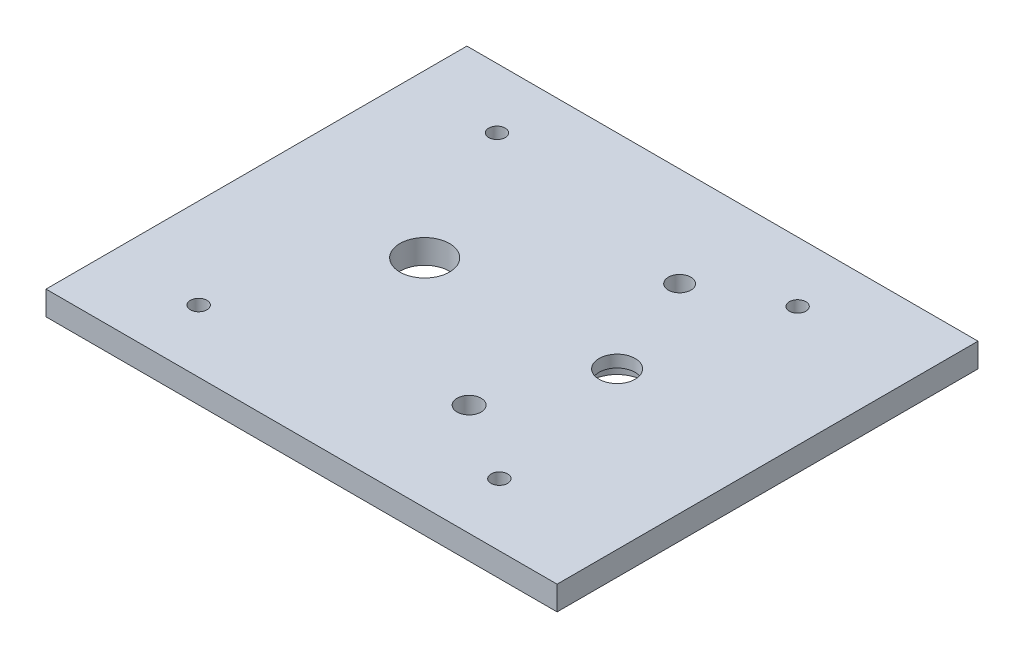
ISO-10303-21;
HEADER;
FILE_DESCRIPTION(('STEP AP214'),'2;1');
FILE_NAME('part.step','',(''),(''),'','','');
FILE_SCHEMA(('AUTOMOTIVE_DESIGN { 1 0 10303 214 1 1 1 1 }'));
ENDSEC;
DATA;
#1=APPLICATION_CONTEXT('core data for automotive mechanical design processes');
#2=APPLICATION_PROTOCOL_DEFINITION('international standard','automotive_design',2000,#1);
#3=PRODUCT_CONTEXT('',#1,'mechanical');
#4=PRODUCT('Part','Part','',(#3));
#5=PRODUCT_RELATED_PRODUCT_CATEGORY('part','',(#4));
#6=PRODUCT_DEFINITION_FORMATION('','',#4);
#7=PRODUCT_DEFINITION_CONTEXT('part definition',#1,'design');
#8=PRODUCT_DEFINITION('design','',#6,#7);
#9=PRODUCT_DEFINITION_SHAPE('','',#8);
#10=(LENGTH_UNIT() NAMED_UNIT(*) SI_UNIT(.MILLI.,.METRE.));
#11=(NAMED_UNIT(*) PLANE_ANGLE_UNIT() SI_UNIT($,.RADIAN.));
#12=(NAMED_UNIT(*) SI_UNIT($,.STERADIAN.) SOLID_ANGLE_UNIT());
#13=UNCERTAINTY_MEASURE_WITH_UNIT(LENGTH_MEASURE(1.E-05),#10,'distance_accuracy_value','');
#14=(GEOMETRIC_REPRESENTATION_CONTEXT(3) GLOBAL_UNCERTAINTY_ASSIGNED_CONTEXT((#13)) GLOBAL_UNIT_ASSIGNED_CONTEXT((#10,
#11,#12)) REPRESENTATION_CONTEXT('',''));
#15=CARTESIAN_POINT('',(0.,0.,0.));
#16=DIRECTION('',(0.,0.,1.));
#17=DIRECTION('',(1.,0.,0.));
#18=AXIS2_PLACEMENT_3D('',#15,#16,#17);
#19=CARTESIAN_POINT('',(42.5,4.,0.));
#20=DIRECTION('',(1.,0.,0.));
#21=DIRECTION('',(0.,0.,-1.));
#22=AXIS2_PLACEMENT_3D('',#19,#20,#21);
#23=PLANE('',#22);
#24=DIRECTION('',(0.,0.,1.));
#25=VECTOR('',#24,1.);
#26=CARTESIAN_POINT('',(42.5,0.,0.));
#27=LINE('',#26,#25);
#28=CARTESIAN_POINT('',(42.5,0.,-35.));
#29=VERTEX_POINT('',#28);
#30=CARTESIAN_POINT('',(42.5,0.,35.));
#31=VERTEX_POINT('',#30);
#32=EDGE_CURVE('E150',#29,#31,#27,.T.);
#33=ORIENTED_EDGE('',*,*,#32,.F.);
#34=DIRECTION('',(0.,-1.,0.));
#35=VECTOR('',#34,1.);
#36=CARTESIAN_POINT('',(42.5,4.,-35.));
#37=LINE('',#36,#35);
#38=CARTESIAN_POINT('',(42.5,4.,-35.));
#39=VERTEX_POINT('',#38);
#40=EDGE_CURVE('E11',#39,#29,#37,.T.);
#41=ORIENTED_EDGE('',*,*,#40,.F.);
#42=DIRECTION('',(0.,0.,1.));
#43=VECTOR('',#42,1.);
#44=CARTESIAN_POINT('',(42.5,4.,0.));
#45=LINE('',#44,#43);
#46=CARTESIAN_POINT('',(42.5,4.,35.));
#47=VERTEX_POINT('',#46);
#48=EDGE_CURVE('E108',#39,#47,#45,.T.);
#49=ORIENTED_EDGE('',*,*,#48,.T.);
#50=DIRECTION('',(0.,-1.,0.));
#51=VECTOR('',#50,1.);
#52=CARTESIAN_POINT('',(42.5,4.,35.));
#53=LINE('',#52,#51);
#54=EDGE_CURVE('E83',#47,#31,#53,.T.);
#55=ORIENTED_EDGE('',*,*,#54,.T.);
#56=EDGE_LOOP('',(#33,#41,#49,#55));
#57=FACE_BOUND('',#56,.T.);
#58=ADVANCED_FACE('F41',(#57),#23,.T.);
#59=CARTESIAN_POINT('',(0.,4.,-35.));
#60=DIRECTION('',(0.,0.,-1.));
#61=DIRECTION('',(-1.,0.,0.));
#62=AXIS2_PLACEMENT_3D('',#59,#60,#61);
#63=PLANE('',#62);
#64=DIRECTION('',(1.,0.,0.));
#65=VECTOR('',#64,1.);
#66=CARTESIAN_POINT('',(0.,0.,-35.));
#67=LINE('',#66,#65);
#68=CARTESIAN_POINT('',(-42.5,0.,-35.));
#69=VERTEX_POINT('',#68);
#70=EDGE_CURVE('E95',#69,#29,#67,.T.);
#71=ORIENTED_EDGE('',*,*,#70,.F.);
#72=DIRECTION('',(0.,-1.,0.));
#73=VECTOR('',#72,1.);
#74=CARTESIAN_POINT('',(-42.5,4.,-35.));
#75=LINE('',#74,#73);
#76=CARTESIAN_POINT('',(-42.5,4.,-35.));
#77=VERTEX_POINT('',#76);
#78=EDGE_CURVE('E52',#77,#69,#75,.T.);
#79=ORIENTED_EDGE('',*,*,#78,.F.);
#80=DIRECTION('',(1.,0.,0.));
#81=VECTOR('',#80,1.);
#82=CARTESIAN_POINT('',(0.,4.,-35.));
#83=LINE('',#82,#81);
#84=EDGE_CURVE('E93',#77,#39,#83,.T.);
#85=ORIENTED_EDGE('',*,*,#84,.T.);
#86=ORIENTED_EDGE('',*,*,#40,.T.);
#87=EDGE_LOOP('',(#71,#79,#85,#86));
#88=FACE_BOUND('',#87,.T.);
#89=ADVANCED_FACE('F91',(#88),#63,.T.);
#90=CARTESIAN_POINT('',(-42.5,4.,0.));
#91=DIRECTION('',(1.,0.,0.));
#92=DIRECTION('',(0.,0.,-1.));
#93=AXIS2_PLACEMENT_3D('',#90,#91,#92);
#94=PLANE('',#93);
#95=DIRECTION('',(0.,0.,1.));
#96=VECTOR('',#95,1.);
#97=CARTESIAN_POINT('',(-42.5,0.,0.));
#98=LINE('',#97,#96);
#99=CARTESIAN_POINT('',(-42.5,0.,35.));
#100=VERTEX_POINT('',#99);
#101=EDGE_CURVE('E155',#69,#100,#98,.T.);
#102=ORIENTED_EDGE('',*,*,#101,.T.);
#103=DIRECTION('',(0.,-1.,0.));
#104=VECTOR('',#103,1.);
#105=CARTESIAN_POINT('',(-42.5,4.,35.));
#106=LINE('',#105,#104);
#107=CARTESIAN_POINT('',(-42.5,4.,35.));
#108=VERTEX_POINT('',#107);
#109=EDGE_CURVE('E99',#108,#100,#106,.T.);
#110=ORIENTED_EDGE('',*,*,#109,.F.);
#111=DIRECTION('',(0.,0.,1.));
#112=VECTOR('',#111,1.);
#113=CARTESIAN_POINT('',(-42.5,4.,0.));
#114=LINE('',#113,#112);
#115=EDGE_CURVE('E102',#77,#108,#114,.T.);
#116=ORIENTED_EDGE('',*,*,#115,.F.);
#117=ORIENTED_EDGE('',*,*,#78,.T.);
#118=EDGE_LOOP('',(#102,#110,#116,#117));
#119=FACE_BOUND('',#118,.T.);
#120=ADVANCED_FACE('F103',(#119),#94,.F.);
#121=CARTESIAN_POINT('',(-15.52,4.,-0.999999999999982));
#122=DIRECTION('',(0.,-1.,0.));
#123=DIRECTION('',(0.,0.,-1.));
#124=AXIS2_PLACEMENT_3D('',#121,#122,#123);
#125=CYLINDRICAL_SURFACE('',#124,4.125);
#126=CARTESIAN_POINT('',(-15.52,4.,-0.999999999999982));
#127=DIRECTION('',(0.,1.,0.));
#128=DIRECTION('',(0.,0.,1.));
#129=AXIS2_PLACEMENT_3D('',#126,#127,#128);
#130=CIRCLE('',#129,4.125);
#131=CARTESIAN_POINT('',(-15.52,4.,3.12500000000002));
#132=VERTEX_POINT('',#131);
#133=EDGE_CURVE('E122',#132,#132,#130,.T.);
#134=ORIENTED_EDGE('',*,*,#133,.T.);
#135=EDGE_LOOP('',(#134));
#136=FACE_BOUND('',#135,.T.);
#137=CARTESIAN_POINT('',(-15.52,0.,-0.999999999999982));
#138=DIRECTION('',(0.,1.,0.));
#139=DIRECTION('',(0.,0.,1.));
#140=AXIS2_PLACEMENT_3D('',#137,#138,#139);
#141=CIRCLE('',#140,4.125);
#142=CARTESIAN_POINT('',(-15.52,0.,3.12500000000002));
#143=VERTEX_POINT('',#142);
#144=EDGE_CURVE('E164',#143,#143,#141,.T.);
#145=ORIENTED_EDGE('',*,*,#144,.F.);
#146=EDGE_LOOP('',(#145));
#147=FACE_BOUND('',#146,.T.);
#148=ADVANCED_FACE('F237',(#136,#147),#125,.F.);
#149=CARTESIAN_POINT('',(-27.5,4.,24.6066772895717));
#150=DIRECTION('',(0.,-1.,0.));
#151=DIRECTION('',(0.,0.,-1.));
#152=AXIS2_PLACEMENT_3D('',#149,#150,#151);
#153=CYLINDRICAL_SURFACE('',#152,1.375);
#154=CARTESIAN_POINT('',(-27.5,4.,24.6066772895717));
#155=DIRECTION('',(0.,1.,0.));
#156=DIRECTION('',(0.,0.,1.));
#157=AXIS2_PLACEMENT_3D('',#154,#155,#156);
#158=CIRCLE('',#157,1.375);
#159=CARTESIAN_POINT('',(-27.5,4.,25.9816772895717));
#160=VERTEX_POINT('',#159);
#161=EDGE_CURVE('E118',#160,#160,#158,.F.);
#162=ORIENTED_EDGE('',*,*,#161,.F.);
#163=EDGE_LOOP('',(#162));
#164=FACE_BOUND('',#163,.T.);
#165=CARTESIAN_POINT('',(-27.5,0.,24.6066772895717));
#166=DIRECTION('',(0.,1.,0.));
#167=DIRECTION('',(0.,0.,1.));
#168=AXIS2_PLACEMENT_3D('',#165,#166,#167);
#169=CIRCLE('',#168,1.375);
#170=CARTESIAN_POINT('',(-27.5,0.,25.9816772895717));
#171=VERTEX_POINT('',#170);
#172=EDGE_CURVE('E160',#171,#171,#169,.F.);
#173=ORIENTED_EDGE('',*,*,#172,.T.);
#174=EDGE_LOOP('',(#173));
#175=FACE_BOUND('',#174,.T.);
#176=ADVANCED_FACE('F240',(#164,#175),#153,.F.);
#177=CARTESIAN_POINT('',(0.,4.,35.));
#178=DIRECTION('',(0.,0.,-1.));
#179=DIRECTION('',(-1.,0.,0.));
#180=AXIS2_PLACEMENT_3D('',#177,#178,#179);
#181=PLANE('',#180);
#182=DIRECTION('',(1.,0.,0.));
#183=VECTOR('',#182,1.);
#184=CARTESIAN_POINT('',(0.,0.,35.));
#185=LINE('',#184,#183);
#186=EDGE_CURVE('E76',#100,#31,#185,.T.);
#187=ORIENTED_EDGE('',*,*,#186,.T.);
#188=ORIENTED_EDGE('',*,*,#54,.F.);
#189=DIRECTION('',(1.,0.,0.));
#190=VECTOR('',#189,1.);
#191=CARTESIAN_POINT('',(0.,4.,35.));
#192=LINE('',#191,#190);
#193=EDGE_CURVE('E60',#108,#47,#192,.T.);
#194=ORIENTED_EDGE('',*,*,#193,.F.);
#195=ORIENTED_EDGE('',*,*,#109,.T.);
#196=EDGE_LOOP('',(#187,#188,#194,#195));
#197=FACE_BOUND('',#196,.T.);
#198=ADVANCED_FACE('F173',(#197),#181,.F.);
#199=CARTESIAN_POINT('',(-27.5,4.,-25.));
#200=DIRECTION('',(0.,-1.,0.));
#201=DIRECTION('',(0.,0.,-1.));
#202=AXIS2_PLACEMENT_3D('',#199,#200,#201);
#203=CYLINDRICAL_SURFACE('',#202,1.375);
#204=CARTESIAN_POINT('',(-27.5,4.,-25.));
#205=DIRECTION('',(0.,1.,0.));
#206=DIRECTION('',(0.,0.,1.));
#207=AXIS2_PLACEMENT_3D('',#204,#205,#206);
#208=CIRCLE('',#207,1.375);
#209=CARTESIAN_POINT('',(-27.5,4.,-23.625));
#210=VERTEX_POINT('',#209);
#211=EDGE_CURVE('E112',#210,#210,#208,.T.);
#212=ORIENTED_EDGE('',*,*,#211,.T.);
#213=EDGE_LOOP('',(#212));
#214=FACE_BOUND('',#213,.T.);
#215=CARTESIAN_POINT('',(-27.5,0.,-25.));
#216=DIRECTION('',(0.,1.,0.));
#217=DIRECTION('',(0.,0.,1.));
#218=AXIS2_PLACEMENT_3D('',#215,#216,#217);
#219=CIRCLE('',#218,1.375);
#220=CARTESIAN_POINT('',(-27.5,0.,-23.625));
#221=VERTEX_POINT('',#220);
#222=EDGE_CURVE('E146',#221,#221,#219,.T.);
#223=ORIENTED_EDGE('',*,*,#222,.F.);
#224=EDGE_LOOP('',(#223));
#225=FACE_BOUND('',#224,.T.);
#226=ADVANCED_FACE('F184',(#214,#225),#203,.F.);
#227=CARTESIAN_POINT('',(22.5,4.,-25.));
#228=DIRECTION('',(0.,-1.,0.));
#229=DIRECTION('',(0.,0.,-1.));
#230=AXIS2_PLACEMENT_3D('',#227,#228,#229);
#231=CYLINDRICAL_SURFACE('',#230,1.375);
#232=CARTESIAN_POINT('',(22.5,4.,-25.));
#233=DIRECTION('',(0.,1.,0.));
#234=DIRECTION('',(0.,0.,1.));
#235=AXIS2_PLACEMENT_3D('',#232,#233,#234);
#236=CIRCLE('',#235,1.375);
#237=CARTESIAN_POINT('',(22.5,4.,-23.625));
#238=VERTEX_POINT('',#237);
#239=EDGE_CURVE('E346',#238,#238,#236,.T.);
#240=ORIENTED_EDGE('',*,*,#239,.T.);
#241=EDGE_LOOP('',(#240));
#242=FACE_BOUND('',#241,.T.);
#243=CARTESIAN_POINT('',(22.5,0.,-25.));
#244=DIRECTION('',(0.,1.,0.));
#245=DIRECTION('',(0.,0.,1.));
#246=AXIS2_PLACEMENT_3D('',#243,#244,#245);
#247=CIRCLE('',#246,1.375);
#248=CARTESIAN_POINT('',(22.5,0.,-23.625));
#249=VERTEX_POINT('',#248);
#250=EDGE_CURVE('E142',#249,#249,#247,.T.);
#251=ORIENTED_EDGE('',*,*,#250,.F.);
#252=EDGE_LOOP('',(#251));
#253=FACE_BOUND('',#252,.T.);
#254=ADVANCED_FACE('F187',(#242,#253),#231,.F.);
#255=CARTESIAN_POINT('',(22.5,4.,24.6066772895717));
#256=DIRECTION('',(0.,-1.,0.));
#257=DIRECTION('',(0.,0.,-1.));
#258=AXIS2_PLACEMENT_3D('',#255,#256,#257);
#259=CYLINDRICAL_SURFACE('',#258,1.375);
#260=CARTESIAN_POINT('',(22.5,4.,24.6066772895717));
#261=DIRECTION('',(0.,1.,0.));
#262=DIRECTION('',(0.,0.,1.));
#263=AXIS2_PLACEMENT_3D('',#260,#261,#262);
#264=CIRCLE('',#263,1.375);
#265=CARTESIAN_POINT('',(22.5,4.,25.9816772895717));
#266=VERTEX_POINT('',#265);
#267=EDGE_CURVE('E342',#266,#266,#264,.F.);
#268=ORIENTED_EDGE('',*,*,#267,.F.);
#269=EDGE_LOOP('',(#268));
#270=FACE_BOUND('',#269,.T.);
#271=CARTESIAN_POINT('',(22.5,0.,24.6066772895717));
#272=DIRECTION('',(0.,1.,0.));
#273=DIRECTION('',(0.,0.,1.));
#274=AXIS2_PLACEMENT_3D('',#271,#272,#273);
#275=CIRCLE('',#274,1.375);
#276=CARTESIAN_POINT('',(22.5,0.,25.9816772895717));
#277=VERTEX_POINT('',#276);
#278=EDGE_CURVE('E138',#277,#277,#275,.F.);
#279=ORIENTED_EDGE('',*,*,#278,.T.);
#280=EDGE_LOOP('',(#279));
#281=FACE_BOUND('',#280,.T.);
#282=ADVANCED_FACE('F191',(#270,#281),#259,.F.);
#283=CARTESIAN_POINT('',(9.40721105156996,4.,-18.4710430680431));
#284=DIRECTION('',(0.,-1.,0.));
#285=DIRECTION('',(0.,0.,-1.));
#286=AXIS2_PLACEMENT_3D('',#283,#284,#285);
#287=CYLINDRICAL_SURFACE('',#286,1.875);
#288=CARTESIAN_POINT('',(9.40721105156996,4.,-18.4710430680431));
#289=DIRECTION('',(0.,1.,0.));
#290=DIRECTION('',(0.,0.,1.));
#291=AXIS2_PLACEMENT_3D('',#288,#289,#290);
#292=CIRCLE('',#291,1.875);
#293=CARTESIAN_POINT('',(9.40721105156996,4.,-16.5960430680431));
#294=VERTEX_POINT('',#293);
#295=EDGE_CURVE('E206',#294,#294,#292,.T.);
#296=ORIENTED_EDGE('',*,*,#295,.T.);
#297=EDGE_LOOP('',(#296));
#298=FACE_BOUND('',#297,.T.);
#299=CARTESIAN_POINT('',(9.40721105156996,0.,-18.4710430680431));
#300=DIRECTION('',(0.,1.,0.));
#301=DIRECTION('',(0.,0.,1.));
#302=AXIS2_PLACEMENT_3D('',#299,#300,#301);
#303=CIRCLE('',#302,1.875);
#304=CARTESIAN_POINT('',(9.40721105156996,0.,-16.5960430680431));
#305=VERTEX_POINT('',#304);
#306=EDGE_CURVE('E134',#305,#305,#303,.T.);
#307=ORIENTED_EDGE('',*,*,#306,.F.);
#308=EDGE_LOOP('',(#307));
#309=FACE_BOUND('',#308,.T.);
#310=ADVANCED_FACE('F194',(#298,#309),#287,.F.);
#311=CARTESIAN_POINT('',(9.40139824124155,4.,16.5289564492602));
#312=DIRECTION('',(0.,-1.,0.));
#313=DIRECTION('',(0.,0.,-1.));
#314=AXIS2_PLACEMENT_3D('',#311,#312,#313);
#315=CYLINDRICAL_SURFACE('',#314,2.);
#316=CARTESIAN_POINT('',(9.40139824124155,4.,16.5289564492602));
#317=DIRECTION('',(0.,1.,0.));
#318=DIRECTION('',(0.,0.,1.));
#319=AXIS2_PLACEMENT_3D('',#316,#317,#318);
#320=CIRCLE('',#319,2.);
#321=CARTESIAN_POINT('',(9.40139824124155,4.,18.5289564492602));
#322=VERTEX_POINT('',#321);
#323=EDGE_CURVE('E168',#322,#322,#320,.T.);
#324=ORIENTED_EDGE('',*,*,#323,.T.);
#325=EDGE_LOOP('',(#324));
#326=FACE_BOUND('',#325,.T.);
#327=CARTESIAN_POINT('',(9.40139824124155,0.,16.5289564492602));
#328=DIRECTION('',(0.,1.,0.));
#329=DIRECTION('',(0.,0.,1.));
#330=AXIS2_PLACEMENT_3D('',#327,#328,#329);
#331=CIRCLE('',#330,2.);
#332=CARTESIAN_POINT('',(9.40139824124155,0.,18.5289564492602));
#333=VERTEX_POINT('',#332);
#334=EDGE_CURVE('E130',#333,#333,#331,.T.);
#335=ORIENTED_EDGE('',*,*,#334,.F.);
#336=EDGE_LOOP('',(#335));
#337=FACE_BOUND('',#336,.T.);
#338=ADVANCED_FACE('F43',(#326,#337),#315,.F.);
#339=CARTESIAN_POINT('',(16.4783394877401,4.,-0.999882702112446));
#340=DIRECTION('',(0.,-1.,0.));
#341=DIRECTION('',(0.,0.,-1.));
#342=AXIS2_PLACEMENT_3D('',#339,#340,#341);
#343=CYLINDRICAL_SURFACE('',#342,2.99999999999999);
#344=CARTESIAN_POINT('',(16.4783394877401,2.,-0.999882702112446));
#345=DIRECTION('',(0.,1.,0.));
#346=DIRECTION('',(0.,0.,1.));
#347=AXIS2_PLACEMENT_3D('',#344,#345,#346);
#348=CIRCLE('',#347,2.99999999999999);
#349=CARTESIAN_POINT('',(16.4783394877401,2.,2.00011729788755));
#350=VERTEX_POINT('',#349);
#351=EDGE_CURVE('E45',#350,#350,#348,.T.);
#352=ORIENTED_EDGE('',*,*,#351,.F.);
#353=EDGE_LOOP('',(#352));
#354=FACE_BOUND('',#353,.T.);
#355=CARTESIAN_POINT('',(16.4783394877401,4.,-0.999882702112446));
#356=DIRECTION('',(0.,1.,0.));
#357=DIRECTION('',(0.,0.,1.));
#358=AXIS2_PLACEMENT_3D('',#355,#356,#357);
#359=CIRCLE('',#358,2.99999999999999);
#360=CARTESIAN_POINT('',(16.4783394877401,4.,2.00011729788755));
#361=VERTEX_POINT('',#360);
#362=EDGE_CURVE('E126',#361,#361,#359,.T.);
#363=ORIENTED_EDGE('',*,*,#362,.T.);
#364=EDGE_LOOP('',(#363));
#365=FACE_BOUND('',#364,.T.);
#366=ADVANCED_FACE('F201',(#354,#365),#343,.F.);
#367=CARTESIAN_POINT('',(0.,4.,0.));
#368=DIRECTION('',(0.,1.,0.));
#369=DIRECTION('',(0.,0.,1.));
#370=AXIS2_PLACEMENT_3D('',#367,#368,#369);
#371=PLANE('',#370);
#372=ORIENTED_EDGE('',*,*,#323,.F.);
#373=EDGE_LOOP('',(#372));
#374=FACE_BOUND('',#373,.T.);
#375=ORIENTED_EDGE('',*,*,#295,.F.);
#376=EDGE_LOOP('',(#375));
#377=FACE_BOUND('',#376,.T.);
#378=ORIENTED_EDGE('',*,*,#267,.T.);
#379=EDGE_LOOP('',(#378));
#380=FACE_BOUND('',#379,.T.);
#381=ORIENTED_EDGE('',*,*,#239,.F.);
#382=EDGE_LOOP('',(#381));
#383=FACE_BOUND('',#382,.T.);
#384=ORIENTED_EDGE('',*,*,#211,.F.);
#385=EDGE_LOOP('',(#384));
#386=FACE_BOUND('',#385,.T.);
#387=ORIENTED_EDGE('',*,*,#48,.F.);
#388=ORIENTED_EDGE('',*,*,#84,.F.);
#389=ORIENTED_EDGE('',*,*,#115,.T.);
#390=ORIENTED_EDGE('',*,*,#193,.T.);
#391=EDGE_LOOP('',(#387,#388,#389,#390));
#392=FACE_BOUND('',#391,.T.);
#393=ORIENTED_EDGE('',*,*,#161,.T.);
#394=EDGE_LOOP('',(#393));
#395=FACE_BOUND('',#394,.T.);
#396=ORIENTED_EDGE('',*,*,#133,.F.);
#397=EDGE_LOOP('',(#396));
#398=FACE_BOUND('',#397,.T.);
#399=ORIENTED_EDGE('',*,*,#362,.F.);
#400=EDGE_LOOP('',(#399));
#401=FACE_BOUND('',#400,.T.);
#402=ADVANCED_FACE('F106',(#374,#377,#380,#383,#386,#392,#395,#398,#401),#371,.T.);
#403=CARTESIAN_POINT('',(0.,0.,0.));
#404=DIRECTION('',(0.,1.,0.));
#405=DIRECTION('',(0.,0.,1.));
#406=AXIS2_PLACEMENT_3D('',#403,#404,#405);
#407=PLANE('',#406);
#408=CARTESIAN_POINT('',(16.4783394877401,0.,-0.999882702112446));
#409=DIRECTION('',(0.,1.,0.));
#410=DIRECTION('',(0.,0.,1.));
#411=AXIS2_PLACEMENT_3D('',#408,#409,#410);
#412=CIRCLE('',#411,4.5);
#413=CARTESIAN_POINT('',(16.4783394877401,0.,3.50011729788756));
#414=VERTEX_POINT('',#413);
#415=EDGE_CURVE('E331',#414,#414,#412,.T.);
#416=ORIENTED_EDGE('',*,*,#415,.T.);
#417=EDGE_LOOP('',(#416));
#418=FACE_BOUND('',#417,.T.);
#419=ORIENTED_EDGE('',*,*,#334,.T.);
#420=EDGE_LOOP('',(#419));
#421=FACE_BOUND('',#420,.T.);
#422=ORIENTED_EDGE('',*,*,#306,.T.);
#423=EDGE_LOOP('',(#422));
#424=FACE_BOUND('',#423,.T.);
#425=ORIENTED_EDGE('',*,*,#278,.F.);
#426=EDGE_LOOP('',(#425));
#427=FACE_BOUND('',#426,.T.);
#428=ORIENTED_EDGE('',*,*,#250,.T.);
#429=EDGE_LOOP('',(#428));
#430=FACE_BOUND('',#429,.T.);
#431=ORIENTED_EDGE('',*,*,#222,.T.);
#432=EDGE_LOOP('',(#431));
#433=FACE_BOUND('',#432,.T.);
#434=ORIENTED_EDGE('',*,*,#32,.T.);
#435=ORIENTED_EDGE('',*,*,#186,.F.);
#436=ORIENTED_EDGE('',*,*,#101,.F.);
#437=ORIENTED_EDGE('',*,*,#70,.T.);
#438=EDGE_LOOP('',(#434,#435,#436,#437));
#439=FACE_BOUND('',#438,.T.);
#440=ORIENTED_EDGE('',*,*,#172,.F.);
#441=EDGE_LOOP('',(#440));
#442=FACE_BOUND('',#441,.T.);
#443=ORIENTED_EDGE('',*,*,#144,.T.);
#444=EDGE_LOOP('',(#443));
#445=FACE_BOUND('',#444,.T.);
#446=ADVANCED_FACE('F174',(#418,#421,#424,#427,#430,#433,#439,#442,#445),#407,.F.);
#447=CARTESIAN_POINT('',(16.4783394877401,2.,-0.999882702112446));
#448=DIRECTION('',(0.,-1.,0.));
#449=DIRECTION('',(0.,0.,-1.));
#450=AXIS2_PLACEMENT_3D('',#447,#448,#449);
#451=CYLINDRICAL_SURFACE('',#450,4.5);
#452=CARTESIAN_POINT('',(16.4783394877401,2.,-0.999882702112446));
#453=DIRECTION('',(0.,1.,0.));
#454=DIRECTION('',(0.,0.,1.));
#455=AXIS2_PLACEMENT_3D('',#452,#453,#454);
#456=CIRCLE('',#455,4.5);
#457=CARTESIAN_POINT('',(16.4783394877401,2.,3.50011729788756));
#458=VERTEX_POINT('',#457);
#459=EDGE_CURVE('E329',#458,#458,#456,.T.);
#460=ORIENTED_EDGE('',*,*,#459,.T.);
#461=EDGE_LOOP('',(#460));
#462=FACE_BOUND('',#461,.T.);
#463=ORIENTED_EDGE('',*,*,#415,.F.);
#464=EDGE_LOOP('',(#463));
#465=FACE_BOUND('',#464,.T.);
#466=ADVANCED_FACE('F211',(#462,#465),#451,.F.);
#467=CARTESIAN_POINT('',(16.4783394877401,2.,-0.999882702112446));
#468=DIRECTION('',(0.,1.,0.));
#469=DIRECTION('',(0.,0.,1.));
#470=AXIS2_PLACEMENT_3D('',#467,#468,#469);
#471=PLANE('',#470);
#472=ORIENTED_EDGE('',*,*,#351,.T.);
#473=EDGE_LOOP('',(#472));
#474=FACE_BOUND('',#473,.T.);
#475=ORIENTED_EDGE('',*,*,#459,.F.);
#476=EDGE_LOOP('',(#475));
#477=FACE_BOUND('',#476,.T.);
#478=ADVANCED_FACE('F226',(#474,#477),#471,.F.);
#479=CLOSED_SHELL('',(#58,#89,#120,#148,#176,#198,#226,#254,#282,#310,#338,#366,#402,#446,#466,#478));
#480=MANIFOLD_SOLID_BREP('B2',#479);
#481=ADVANCED_BREP_SHAPE_REPRESENTATION('',(#18,#480),#14);
#482=SHAPE_DEFINITION_REPRESENTATION(#9,#481);
ENDSEC;
END-ISO-10303-21;
